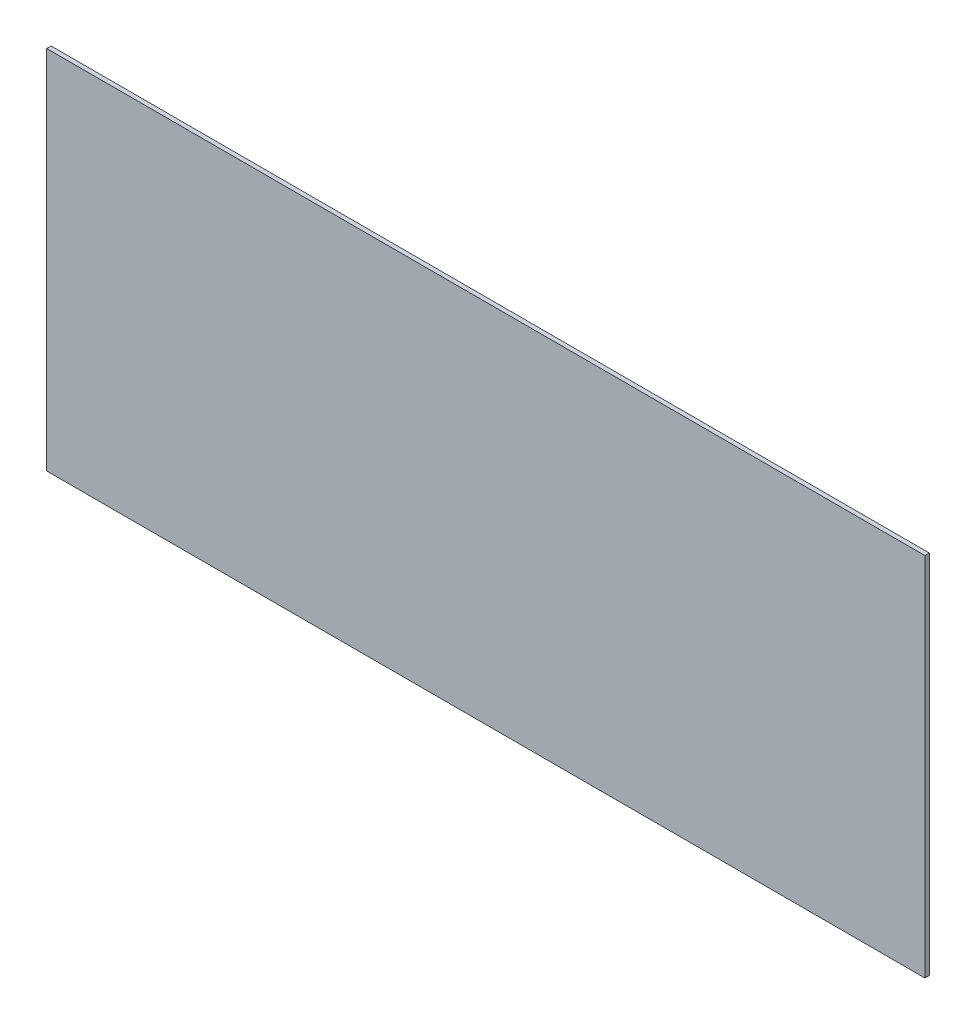
ISO-10303-21;
HEADER;
FILE_DESCRIPTION(('STEP AP214'),'2;1');
FILE_NAME('part.step','',(''),(''),'','','');
FILE_SCHEMA(('AUTOMOTIVE_DESIGN { 1 0 10303 214 1 1 1 1 }'));
ENDSEC;
DATA;
#1=APPLICATION_CONTEXT('core data for automotive mechanical design processes');
#2=APPLICATION_PROTOCOL_DEFINITION('international standard','automotive_design',2000,#1);
#3=PRODUCT_CONTEXT('',#1,'mechanical');
#4=PRODUCT('Part','Part','',(#3));
#5=PRODUCT_RELATED_PRODUCT_CATEGORY('part','',(#4));
#6=PRODUCT_DEFINITION_FORMATION('','',#4);
#7=PRODUCT_DEFINITION_CONTEXT('part definition',#1,'design');
#8=PRODUCT_DEFINITION('design','',#6,#7);
#9=PRODUCT_DEFINITION_SHAPE('','',#8);
#10=(LENGTH_UNIT() NAMED_UNIT(*) SI_UNIT(.MILLI.,.METRE.));
#11=(NAMED_UNIT(*) PLANE_ANGLE_UNIT() SI_UNIT($,.RADIAN.));
#12=(NAMED_UNIT(*) SI_UNIT($,.STERADIAN.) SOLID_ANGLE_UNIT());
#13=UNCERTAINTY_MEASURE_WITH_UNIT(LENGTH_MEASURE(1.E-05),#10,'distance_accuracy_value','');
#14=(GEOMETRIC_REPRESENTATION_CONTEXT(3) GLOBAL_UNCERTAINTY_ASSIGNED_CONTEXT((#13)) GLOBAL_UNIT_ASSIGNED_CONTEXT((#10,
#11,#12)) REPRESENTATION_CONTEXT('',''));
#15=CARTESIAN_POINT('',(0.,0.,0.));
#16=DIRECTION('',(0.,0.,1.));
#17=DIRECTION('',(1.,0.,0.));
#18=AXIS2_PLACEMENT_3D('',#15,#16,#17);
#19=CARTESIAN_POINT('',(0.,250.,0.));
#20=DIRECTION('',(1.,0.,0.));
#21=DIRECTION('',(0.,0.,-1.));
#22=AXIS2_PLACEMENT_3D('',#19,#20,#21);
#23=PLANE('',#22);
#24=DIRECTION('',(0.,0.,1.));
#25=VECTOR('',#24,1.);
#26=CARTESIAN_POINT('',(0.,0.,0.));
#27=LINE('',#26,#25);
#28=CARTESIAN_POINT('',(0.,0.,-3.));
#29=VERTEX_POINT('',#28);
#30=CARTESIAN_POINT('',(0.,0.,0.));
#31=VERTEX_POINT('',#30);
#32=EDGE_CURVE('E96',#29,#31,#27,.T.);
#33=ORIENTED_EDGE('',*,*,#32,.T.);
#34=DIRECTION('',(0.,-1.,0.));
#35=VECTOR('',#34,1.);
#36=CARTESIAN_POINT('',(0.,250.,0.));
#37=LINE('',#36,#35);
#38=CARTESIAN_POINT('',(0.,250.,0.));
#39=VERTEX_POINT('',#38);
#40=EDGE_CURVE('E11',#39,#31,#37,.T.);
#41=ORIENTED_EDGE('',*,*,#40,.F.);
#42=DIRECTION('',(0.,0.,1.));
#43=VECTOR('',#42,1.);
#44=CARTESIAN_POINT('',(0.,250.,0.));
#45=LINE('',#44,#43);
#46=CARTESIAN_POINT('',(0.,250.,-3.));
#47=VERTEX_POINT('',#46);
#48=EDGE_CURVE('E84',#47,#39,#45,.T.);
#49=ORIENTED_EDGE('',*,*,#48,.F.);
#50=DIRECTION('',(0.,-1.,0.));
#51=VECTOR('',#50,1.);
#52=CARTESIAN_POINT('',(0.,250.,-3.));
#53=LINE('',#52,#51);
#54=EDGE_CURVE('E92',#47,#29,#53,.T.);
#55=ORIENTED_EDGE('',*,*,#54,.T.);
#56=EDGE_LOOP('',(#33,#41,#49,#55));
#57=FACE_BOUND('',#56,.T.);
#58=ADVANCED_FACE('F33',(#57),#23,.F.);
#59=CARTESIAN_POINT('',(0.,250.,0.));
#60=DIRECTION('',(0.,0.,-1.));
#61=DIRECTION('',(-1.,0.,0.));
#62=AXIS2_PLACEMENT_3D('',#59,#60,#61);
#63=PLANE('',#62);
#64=DIRECTION('',(1.,0.,0.));
#65=VECTOR('',#64,1.);
#66=CARTESIAN_POINT('',(0.,0.,0.));
#67=LINE('',#66,#65);
#68=CARTESIAN_POINT('',(600.,0.,0.));
#69=VERTEX_POINT('',#68);
#70=EDGE_CURVE('E88',#31,#69,#67,.T.);
#71=ORIENTED_EDGE('',*,*,#70,.T.);
#72=DIRECTION('',(0.,-1.,0.));
#73=VECTOR('',#72,1.);
#74=CARTESIAN_POINT('',(600.,250.,0.));
#75=LINE('',#74,#73);
#76=CARTESIAN_POINT('',(600.,250.,0.));
#77=VERTEX_POINT('',#76);
#78=EDGE_CURVE('E41',#77,#69,#75,.T.);
#79=ORIENTED_EDGE('',*,*,#78,.F.);
#80=DIRECTION('',(1.,0.,0.));
#81=VECTOR('',#80,1.);
#82=CARTESIAN_POINT('',(0.,250.,0.));
#83=LINE('',#82,#81);
#84=EDGE_CURVE('E79',#39,#77,#83,.T.);
#85=ORIENTED_EDGE('',*,*,#84,.F.);
#86=ORIENTED_EDGE('',*,*,#40,.T.);
#87=EDGE_LOOP('',(#71,#79,#85,#86));
#88=FACE_BOUND('',#87,.T.);
#89=ADVANCED_FACE('F87',(#88),#63,.F.);
#90=CARTESIAN_POINT('',(600.,250.,0.));
#91=DIRECTION('',(-1.,0.,0.));
#92=DIRECTION('',(0.,0.,1.));
#93=AXIS2_PLACEMENT_3D('',#90,#91,#92);
#94=PLANE('',#93);
#95=DIRECTION('',(0.,0.,-1.));
#96=VECTOR('',#95,1.);
#97=CARTESIAN_POINT('',(600.,0.,0.));
#98=LINE('',#97,#96);
#99=CARTESIAN_POINT('',(600.,0.,-3.));
#100=VERTEX_POINT('',#99);
#101=EDGE_CURVE('E66',#69,#100,#98,.T.);
#102=ORIENTED_EDGE('',*,*,#101,.T.);
#103=DIRECTION('',(0.,-1.,0.));
#104=VECTOR('',#103,1.);
#105=CARTESIAN_POINT('',(600.,250.,-3.));
#106=LINE('',#105,#104);
#107=CARTESIAN_POINT('',(600.,250.,-3.));
#108=VERTEX_POINT('',#107);
#109=EDGE_CURVE('E89',#108,#100,#106,.T.);
#110=ORIENTED_EDGE('',*,*,#109,.F.);
#111=DIRECTION('',(0.,0.,-1.));
#112=VECTOR('',#111,1.);
#113=CARTESIAN_POINT('',(600.,250.,0.));
#114=LINE('',#113,#112);
#115=EDGE_CURVE('E82',#77,#108,#114,.T.);
#116=ORIENTED_EDGE('',*,*,#115,.F.);
#117=ORIENTED_EDGE('',*,*,#78,.T.);
#118=EDGE_LOOP('',(#102,#110,#116,#117));
#119=FACE_BOUND('',#118,.T.);
#120=ADVANCED_FACE('F90',(#119),#94,.F.);
#121=CARTESIAN_POINT('',(0.,250.,-3.));
#122=DIRECTION('',(0.,0.,1.));
#123=DIRECTION('',(1.,0.,0.));
#124=AXIS2_PLACEMENT_3D('',#121,#122,#123);
#125=PLANE('',#124);
#126=DIRECTION('',(-1.,0.,0.));
#127=VECTOR('',#126,1.);
#128=CARTESIAN_POINT('',(0.,0.,-3.));
#129=LINE('',#128,#127);
#130=EDGE_CURVE('E72',#100,#29,#129,.T.);
#131=ORIENTED_EDGE('',*,*,#130,.T.);
#132=ORIENTED_EDGE('',*,*,#54,.F.);
#133=DIRECTION('',(-1.,0.,0.));
#134=VECTOR('',#133,1.);
#135=CARTESIAN_POINT('',(0.,250.,-3.));
#136=LINE('',#135,#134);
#137=EDGE_CURVE('E49',#108,#47,#136,.T.);
#138=ORIENTED_EDGE('',*,*,#137,.F.);
#139=ORIENTED_EDGE('',*,*,#109,.T.);
#140=EDGE_LOOP('',(#131,#132,#138,#139));
#141=FACE_BOUND('',#140,.T.);
#142=ADVANCED_FACE('F103',(#141),#125,.F.);
#143=CARTESIAN_POINT('',(0.,250.,0.));
#144=DIRECTION('',(0.,-1.,0.));
#145=DIRECTION('',(0.,0.,-1.));
#146=AXIS2_PLACEMENT_3D('',#143,#144,#145);
#147=PLANE('',#146);
#148=ORIENTED_EDGE('',*,*,#48,.T.);
#149=ORIENTED_EDGE('',*,*,#84,.T.);
#150=ORIENTED_EDGE('',*,*,#115,.T.);
#151=ORIENTED_EDGE('',*,*,#137,.T.);
#152=EDGE_LOOP('',(#148,#149,#150,#151));
#153=FACE_BOUND('',#152,.T.);
#154=ADVANCED_FACE('F80',(#153),#147,.F.);
#155=CARTESIAN_POINT('',(0.,0.,0.));
#156=DIRECTION('',(0.,-1.,0.));
#157=DIRECTION('',(0.,0.,-1.));
#158=AXIS2_PLACEMENT_3D('',#155,#156,#157);
#159=PLANE('',#158);
#160=ORIENTED_EDGE('',*,*,#32,.F.);
#161=ORIENTED_EDGE('',*,*,#130,.F.);
#162=ORIENTED_EDGE('',*,*,#101,.F.);
#163=ORIENTED_EDGE('',*,*,#70,.F.);
#164=EDGE_LOOP('',(#160,#161,#162,#163));
#165=FACE_BOUND('',#164,.T.);
#166=ADVANCED_FACE('F106',(#165),#159,.T.);
#167=CLOSED_SHELL('',(#58,#89,#120,#142,#154,#166));
#168=MANIFOLD_SOLID_BREP('B2',#167);
#169=ADVANCED_BREP_SHAPE_REPRESENTATION('',(#18,#168),#14);
#170=SHAPE_DEFINITION_REPRESENTATION(#9,#169);
ENDSEC;
END-ISO-10303-21;
